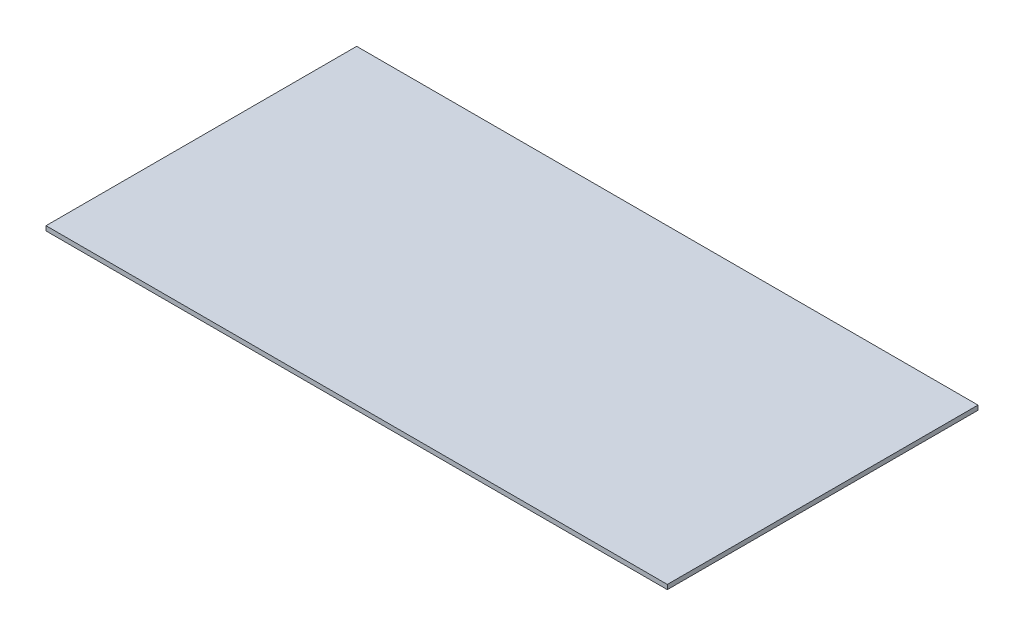
ISO-10303-21;
HEADER;
FILE_DESCRIPTION(('STEP AP214'),'2;1');
FILE_NAME('part.step','',(''),(''),'','','');
FILE_SCHEMA(('AUTOMOTIVE_DESIGN { 1 0 10303 214 1 1 1 1 }'));
ENDSEC;
DATA;
#1=APPLICATION_CONTEXT('core data for automotive mechanical design processes');
#2=APPLICATION_PROTOCOL_DEFINITION('international standard','automotive_design',2000,#1);
#3=PRODUCT_CONTEXT('',#1,'mechanical');
#4=PRODUCT('Part','Part','',(#3));
#5=PRODUCT_RELATED_PRODUCT_CATEGORY('part','',(#4));
#6=PRODUCT_DEFINITION_FORMATION('','',#4);
#7=PRODUCT_DEFINITION_CONTEXT('part definition',#1,'design');
#8=PRODUCT_DEFINITION('design','',#6,#7);
#9=PRODUCT_DEFINITION_SHAPE('','',#8);
#10=(LENGTH_UNIT() NAMED_UNIT(*) SI_UNIT(.MILLI.,.METRE.));
#11=(NAMED_UNIT(*) PLANE_ANGLE_UNIT() SI_UNIT($,.RADIAN.));
#12=(NAMED_UNIT(*) SI_UNIT($,.STERADIAN.) SOLID_ANGLE_UNIT());
#13=UNCERTAINTY_MEASURE_WITH_UNIT(LENGTH_MEASURE(1.E-05),#10,'distance_accuracy_value','');
#14=(GEOMETRIC_REPRESENTATION_CONTEXT(3) GLOBAL_UNCERTAINTY_ASSIGNED_CONTEXT((#13)) GLOBAL_UNIT_ASSIGNED_CONTEXT((#10,
#11,#12)) REPRESENTATION_CONTEXT('',''));
#15=CARTESIAN_POINT('',(0.,0.,0.));
#16=DIRECTION('',(0.,0.,1.));
#17=DIRECTION('',(1.,0.,0.));
#18=AXIS2_PLACEMENT_3D('',#15,#16,#17);
#19=CARTESIAN_POINT('',(1219.2,-8.9281,-609.6));
#20=DIRECTION('',(1.,0.,0.));
#21=DIRECTION('',(0.,0.,-1.));
#22=AXIS2_PLACEMENT_3D('',#19,#20,#21);
#23=PLANE('',#22);
#24=DIRECTION('',(0.,1.,0.));
#25=VECTOR('',#24,1.);
#26=CARTESIAN_POINT('',(1219.2,-8.9281,-609.6));
#27=LINE('',#26,#25);
#28=CARTESIAN_POINT('',(1219.2,-8.9281,-609.6));
#29=VERTEX_POINT('',#28);
#30=CARTESIAN_POINT('',(1219.2,8.9281,-609.6));
#31=VERTEX_POINT('',#30);
#32=EDGE_CURVE('E42',#29,#31,#27,.T.);
#33=ORIENTED_EDGE('',*,*,#32,.T.);
#34=DIRECTION('',(0.,0.,-1.));
#35=VECTOR('',#34,1.);
#36=CARTESIAN_POINT('',(1219.2,8.9281,-609.6));
#37=LINE('',#36,#35);
#38=CARTESIAN_POINT('',(1219.2,8.9281,609.6));
#39=VERTEX_POINT('',#38);
#40=EDGE_CURVE('E80',#39,#31,#37,.T.);
#41=ORIENTED_EDGE('',*,*,#40,.F.);
#42=DIRECTION('',(0.,1.,0.));
#43=VECTOR('',#42,1.);
#44=CARTESIAN_POINT('',(1219.2,-8.9281,609.6));
#45=LINE('',#44,#43);
#46=CARTESIAN_POINT('',(1219.2,-8.9281,609.6));
#47=VERTEX_POINT('',#46);
#48=EDGE_CURVE('E11',#47,#39,#45,.T.);
#49=ORIENTED_EDGE('',*,*,#48,.F.);
#50=DIRECTION('',(0.,0.,-1.));
#51=VECTOR('',#50,1.);
#52=CARTESIAN_POINT('',(1219.2,-8.9281,-609.6));
#53=LINE('',#52,#51);
#54=EDGE_CURVE('E81',#47,#29,#53,.T.);
#55=ORIENTED_EDGE('',*,*,#54,.T.);
#56=EDGE_LOOP('',(#33,#41,#49,#55));
#57=FACE_BOUND('',#56,.T.);
#58=ADVANCED_FACE('F39',(#57),#23,.T.);
#59=CARTESIAN_POINT('',(-1219.2,-8.9281,609.6));
#60=DIRECTION('',(0.,0.,1.));
#61=DIRECTION('',(1.,0.,0.));
#62=AXIS2_PLACEMENT_3D('',#59,#60,#61);
#63=PLANE('',#62);
#64=ORIENTED_EDGE('',*,*,#48,.T.);
#65=DIRECTION('',(1.,0.,0.));
#66=VECTOR('',#65,1.);
#67=CARTESIAN_POINT('',(-1219.2,8.9281,609.6));
#68=LINE('',#67,#66);
#69=CARTESIAN_POINT('',(-1219.2,8.9281,609.6));
#70=VERTEX_POINT('',#69);
#71=EDGE_CURVE('E99',#70,#39,#68,.T.);
#72=ORIENTED_EDGE('',*,*,#71,.F.);
#73=DIRECTION('',(0.,1.,0.));
#74=VECTOR('',#73,1.);
#75=CARTESIAN_POINT('',(-1219.2,-8.9281,609.6));
#76=LINE('',#75,#74);
#77=CARTESIAN_POINT('',(-1219.2,-8.9281,609.6));
#78=VERTEX_POINT('',#77);
#79=EDGE_CURVE('E48',#78,#70,#76,.T.);
#80=ORIENTED_EDGE('',*,*,#79,.F.);
#81=DIRECTION('',(1.,0.,0.));
#82=VECTOR('',#81,1.);
#83=CARTESIAN_POINT('',(-1219.2,-8.9281,609.6));
#84=LINE('',#83,#82);
#85=EDGE_CURVE('E87',#78,#47,#84,.T.);
#86=ORIENTED_EDGE('',*,*,#85,.T.);
#87=EDGE_LOOP('',(#64,#72,#80,#86));
#88=FACE_BOUND('',#87,.T.);
#89=ADVANCED_FACE('F123',(#88),#63,.T.);
#90=CARTESIAN_POINT('',(-1219.2,-8.9281,-609.6));
#91=DIRECTION('',(-1.,0.,0.));
#92=DIRECTION('',(0.,0.,1.));
#93=AXIS2_PLACEMENT_3D('',#90,#91,#92);
#94=PLANE('',#93);
#95=ORIENTED_EDGE('',*,*,#79,.T.);
#96=DIRECTION('',(0.,0.,1.));
#97=VECTOR('',#96,1.);
#98=CARTESIAN_POINT('',(-1219.2,8.9281,-609.6));
#99=LINE('',#98,#97);
#100=CARTESIAN_POINT('',(-1219.2,8.9281,-609.6));
#101=VERTEX_POINT('',#100);
#102=EDGE_CURVE('E95',#101,#70,#99,.T.);
#103=ORIENTED_EDGE('',*,*,#102,.F.);
#104=DIRECTION('',(0.,1.,0.));
#105=VECTOR('',#104,1.);
#106=CARTESIAN_POINT('',(-1219.2,-8.9281,-609.6));
#107=LINE('',#106,#105);
#108=CARTESIAN_POINT('',(-1219.2,-8.9281,-609.6));
#109=VERTEX_POINT('',#108);
#110=EDGE_CURVE('E86',#109,#101,#107,.T.);
#111=ORIENTED_EDGE('',*,*,#110,.F.);
#112=DIRECTION('',(0.,0.,1.));
#113=VECTOR('',#112,1.);
#114=CARTESIAN_POINT('',(-1219.2,-8.9281,-609.6));
#115=LINE('',#114,#113);
#116=EDGE_CURVE('E112',#109,#78,#115,.T.);
#117=ORIENTED_EDGE('',*,*,#116,.T.);
#118=EDGE_LOOP('',(#95,#103,#111,#117));
#119=FACE_BOUND('',#118,.T.);
#120=ADVANCED_FACE('F120',(#119),#94,.T.);
#121=CARTESIAN_POINT('',(-1219.2,-8.9281,-609.6));
#122=DIRECTION('',(0.,0.,-1.));
#123=DIRECTION('',(-1.,0.,0.));
#124=AXIS2_PLACEMENT_3D('',#121,#122,#123);
#125=PLANE('',#124);
#126=ORIENTED_EDGE('',*,*,#110,.T.);
#127=DIRECTION('',(-1.,0.,0.));
#128=VECTOR('',#127,1.);
#129=CARTESIAN_POINT('',(-1219.2,8.9281,-609.6));
#130=LINE('',#129,#128);
#131=EDGE_CURVE('E89',#31,#101,#130,.T.);
#132=ORIENTED_EDGE('',*,*,#131,.F.);
#133=ORIENTED_EDGE('',*,*,#32,.F.);
#134=DIRECTION('',(-1.,0.,0.));
#135=VECTOR('',#134,1.);
#136=CARTESIAN_POINT('',(-1219.2,-8.9281,-609.6));
#137=LINE('',#136,#135);
#138=EDGE_CURVE('E109',#29,#109,#137,.T.);
#139=ORIENTED_EDGE('',*,*,#138,.T.);
#140=EDGE_LOOP('',(#126,#132,#133,#139));
#141=FACE_BOUND('',#140,.T.);
#142=ADVANCED_FACE('F90',(#141),#125,.T.);
#143=CARTESIAN_POINT('',(0.,-8.9281,0.));
#144=DIRECTION('',(0.,1.,0.));
#145=DIRECTION('',(0.,0.,1.));
#146=AXIS2_PLACEMENT_3D('',#143,#144,#145);
#147=PLANE('',#146);
#148=ORIENTED_EDGE('',*,*,#54,.F.);
#149=ORIENTED_EDGE('',*,*,#85,.F.);
#150=ORIENTED_EDGE('',*,*,#116,.F.);
#151=ORIENTED_EDGE('',*,*,#138,.F.);
#152=EDGE_LOOP('',(#148,#149,#150,#151));
#153=FACE_BOUND('',#152,.T.);
#154=ADVANCED_FACE('F125',(#153),#147,.F.);
#155=CARTESIAN_POINT('',(0.,8.9281,0.));
#156=DIRECTION('',(0.,1.,0.));
#157=DIRECTION('',(0.,0.,1.));
#158=AXIS2_PLACEMENT_3D('',#155,#156,#157);
#159=PLANE('',#158);
#160=ORIENTED_EDGE('',*,*,#40,.T.);
#161=ORIENTED_EDGE('',*,*,#131,.T.);
#162=ORIENTED_EDGE('',*,*,#102,.T.);
#163=ORIENTED_EDGE('',*,*,#71,.T.);
#164=EDGE_LOOP('',(#160,#161,#162,#163));
#165=FACE_BOUND('',#164,.T.);
#166=ADVANCED_FACE('F98',(#165),#159,.T.);
#167=CLOSED_SHELL('',(#58,#89,#120,#142,#154,#166));
#168=MANIFOLD_SOLID_BREP('B2',#167);
#169=ADVANCED_BREP_SHAPE_REPRESENTATION('',(#18,#168),#14);
#170=SHAPE_DEFINITION_REPRESENTATION(#9,#169);
ENDSEC;
END-ISO-10303-21;
